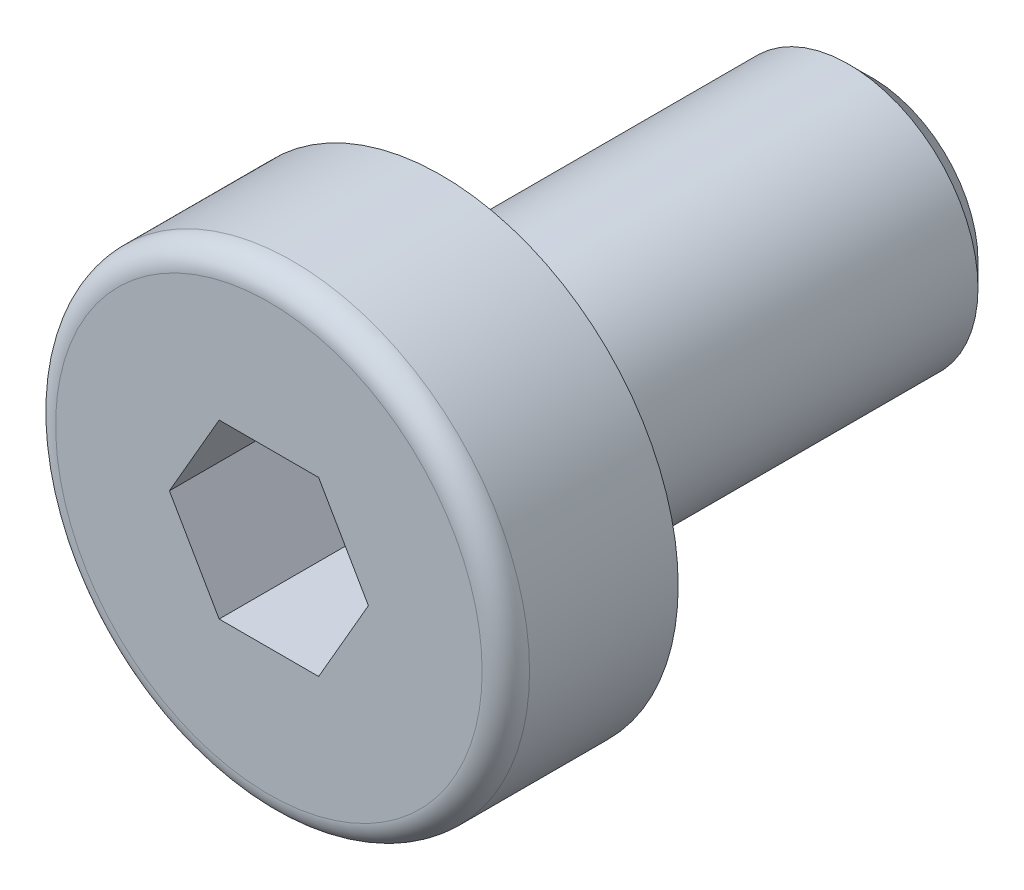
ISO-10303-21;
HEADER;
FILE_DESCRIPTION(('STEP AP214'),'2;1');
FILE_NAME('part.step','',(''),(''),'','','');
FILE_SCHEMA(('AUTOMOTIVE_DESIGN { 1 0 10303 214 1 1 1 1 }'));
ENDSEC;
DATA;
#1=APPLICATION_CONTEXT('core data for automotive mechanical design processes');
#2=APPLICATION_PROTOCOL_DEFINITION('international standard','automotive_design',2000,#1);
#3=PRODUCT_CONTEXT('',#1,'mechanical');
#4=PRODUCT('Part','Part','',(#3));
#5=PRODUCT_RELATED_PRODUCT_CATEGORY('part','',(#4));
#6=PRODUCT_DEFINITION_FORMATION('','',#4);
#7=PRODUCT_DEFINITION_CONTEXT('part definition',#1,'design');
#8=PRODUCT_DEFINITION('design','',#6,#7);
#9=PRODUCT_DEFINITION_SHAPE('','',#8);
#10=(LENGTH_UNIT() NAMED_UNIT(*) SI_UNIT(.MILLI.,.METRE.));
#11=(NAMED_UNIT(*) PLANE_ANGLE_UNIT() SI_UNIT($,.RADIAN.));
#12=(NAMED_UNIT(*) SI_UNIT($,.STERADIAN.) SOLID_ANGLE_UNIT());
#13=UNCERTAINTY_MEASURE_WITH_UNIT(LENGTH_MEASURE(1.E-05),#10,'distance_accuracy_value','');
#14=(GEOMETRIC_REPRESENTATION_CONTEXT(3) GLOBAL_UNCERTAINTY_ASSIGNED_CONTEXT((#13)) GLOBAL_UNIT_ASSIGNED_CONTEXT((#10,
#11,#12)) REPRESENTATION_CONTEXT('',''));
#15=CARTESIAN_POINT('',(0.,0.,0.));
#16=DIRECTION('',(0.,0.,1.));
#17=DIRECTION('',(1.,0.,0.));
#18=AXIS2_PLACEMENT_3D('',#15,#16,#17);
#19=CARTESIAN_POINT('',(0.,0.,2.));
#20=DIRECTION('',(0.,0.,1.));
#21=DIRECTION('',(1.,0.,0.));
#22=AXIS2_PLACEMENT_3D('',#19,#20,#21);
#23=CYLINDRICAL_SURFACE('',#22,1.5);
#24=CARTESIAN_POINT('',(0.,0.,-0.15));
#25=DIRECTION('',(0.,0.,1.));
#26=DIRECTION('',(1.,0.,0.));
#27=AXIS2_PLACEMENT_3D('',#24,#25,#26);
#28=CIRCLE('',#27,1.5);
#29=CARTESIAN_POINT('',(1.5,0.,-0.15));
#30=VERTEX_POINT('',#29);
#31=EDGE_CURVE('E135',#30,#30,#28,.T.);
#32=ORIENTED_EDGE('',*,*,#31,.F.);
#33=EDGE_LOOP('',(#32));
#34=FACE_BOUND('',#33,.T.);
#35=CARTESIAN_POINT('',(0.,0.,-0.155));
#36=DIRECTION('',(0.,0.,1.));
#37=DIRECTION('',(1.,0.,0.));
#38=AXIS2_PLACEMENT_3D('',#35,#36,#37);
#39=CIRCLE('',#38,1.5);
#40=CARTESIAN_POINT('',(1.5,0.,-0.155));
#41=VERTEX_POINT('',#40);
#42=EDGE_CURVE('E290',#41,#41,#39,.T.);
#43=ORIENTED_EDGE('',*,*,#42,.T.);
#44=EDGE_LOOP('',(#43));
#45=FACE_BOUND('',#44,.T.);
#46=ADVANCED_FACE('F16',(#34,#45),#23,.T.);
#47=CARTESIAN_POINT('',(0.,0.,2.));
#48=DIRECTION('',(0.,0.,1.));
#49=DIRECTION('',(1.,0.,0.));
#50=AXIS2_PLACEMENT_3D('',#47,#48,#49);
#51=PLANE('',#50);
#52=CARTESIAN_POINT('',(0.,0.,2.));
#53=DIRECTION('',(0.,0.,1.));
#54=DIRECTION('',(1.,0.,0.));
#55=AXIS2_PLACEMENT_3D('',#52,#53,#54);
#56=CIRCLE('',#55,2.475);
#57=CARTESIAN_POINT('',(2.475,0.,2.));
#58=VERTEX_POINT('',#57);
#59=EDGE_CURVE('E119',#58,#58,#56,.T.);
#60=ORIENTED_EDGE('',*,*,#59,.T.);
#61=EDGE_LOOP('',(#60));
#62=FACE_BOUND('',#61,.T.);
#63=DIRECTION('',(1.,0.,0.));
#64=VECTOR('',#63,1.);
#65=CARTESIAN_POINT('',(-0.57735,0.999999533749891,2.));
#66=LINE('',#65,#64);
#67=CARTESIAN_POINT('',(-0.57735,0.999999533749891,2.));
#68=VERTEX_POINT('',#67);
#69=CARTESIAN_POINT('',(0.57735,0.999999533749892,2.));
#70=VERTEX_POINT('',#69);
#71=EDGE_CURVE('E96',#68,#70,#66,.T.);
#72=ORIENTED_EDGE('',*,*,#71,.T.);
#73=DIRECTION('',(0.5,-0.866025403784439,0.));
#74=VECTOR('',#73,1.);
#75=CARTESIAN_POINT('',(0.57735,0.999999533749892,2.));
#76=LINE('',#75,#74);
#77=CARTESIAN_POINT('',(1.1547,0.,2.));
#78=VERTEX_POINT('',#77);
#79=EDGE_CURVE('E32',#70,#78,#76,.T.);
#80=ORIENTED_EDGE('',*,*,#79,.T.);
#81=DIRECTION('',(-0.5,-0.866025403784439,0.));
#82=VECTOR('',#81,1.);
#83=CARTESIAN_POINT('',(1.1547,0.,2.));
#84=LINE('',#83,#82);
#85=CARTESIAN_POINT('',(0.57735,-0.999999533749891,2.));
#86=VERTEX_POINT('',#85);
#87=EDGE_CURVE('E202',#78,#86,#84,.T.);
#88=ORIENTED_EDGE('',*,*,#87,.T.);
#89=DIRECTION('',(-1.,0.,0.));
#90=VECTOR('',#89,1.);
#91=CARTESIAN_POINT('',(0.57735,-0.999999533749891,2.));
#92=LINE('',#91,#90);
#93=CARTESIAN_POINT('',(-0.57735,-0.999999533749892,2.));
#94=VERTEX_POINT('',#93);
#95=EDGE_CURVE('E265',#86,#94,#92,.T.);
#96=ORIENTED_EDGE('',*,*,#95,.T.);
#97=DIRECTION('',(-0.5,0.866025403784439,0.));
#98=VECTOR('',#97,1.);
#99=CARTESIAN_POINT('',(-0.57735,-0.999999533749892,2.));
#100=LINE('',#99,#98);
#101=CARTESIAN_POINT('',(-1.1547,0.,2.));
#102=VERTEX_POINT('',#101);
#103=EDGE_CURVE('E259',#94,#102,#100,.T.);
#104=ORIENTED_EDGE('',*,*,#103,.T.);
#105=DIRECTION('',(0.5,0.866025403784439,0.));
#106=VECTOR('',#105,1.);
#107=CARTESIAN_POINT('',(-1.1547,0.,2.));
#108=LINE('',#107,#106);
#109=EDGE_CURVE('E105',#102,#68,#108,.T.);
#110=ORIENTED_EDGE('',*,*,#109,.T.);
#111=EDGE_LOOP('',(#72,#80,#88,#96,#104,#110));
#112=FACE_BOUND('',#111,.T.);
#113=ADVANCED_FACE('F159',(#62,#112),#51,.T.);
#114=CARTESIAN_POINT('',(0.,0.,-0.15));
#115=DIRECTION('',(0.,0.,1.));
#116=DIRECTION('',(1.,0.,0.));
#117=AXIS2_PLACEMENT_3D('',#114,#115,#116);
#118=TOROIDAL_SURFACE('',#117,1.65,0.15);
#119=ORIENTED_EDGE('',*,*,#31,.T.);
#120=EDGE_LOOP('',(#119));
#121=FACE_BOUND('',#120,.T.);
#122=CARTESIAN_POINT('',(0.,0.,0.));
#123=DIRECTION('',(0.,0.,1.));
#124=DIRECTION('',(1.,0.,0.));
#125=AXIS2_PLACEMENT_3D('',#122,#123,#124);
#126=CIRCLE('',#125,1.65);
#127=CARTESIAN_POINT('',(1.65,0.,0.));
#128=VERTEX_POINT('',#127);
#129=EDGE_CURVE('E131',#128,#128,#126,.T.);
#130=ORIENTED_EDGE('',*,*,#129,.F.);
#131=EDGE_LOOP('',(#130));
#132=FACE_BOUND('',#131,.T.);
#133=ADVANCED_FACE('F164',(#121,#132),#118,.F.);
#134=CARTESIAN_POINT('',(0.,2.75,0.));
#135=DIRECTION('',(0.,0.,-1.));
#136=DIRECTION('',(-1.,0.,0.));
#137=AXIS2_PLACEMENT_3D('',#134,#135,#136);
#138=PLANE('',#137);
#139=ORIENTED_EDGE('',*,*,#129,.T.);
#140=EDGE_LOOP('',(#139));
#141=FACE_BOUND('',#140,.T.);
#142=CARTESIAN_POINT('',(0.,0.,0.));
#143=DIRECTION('',(0.,0.,1.));
#144=DIRECTION('',(1.,0.,0.));
#145=AXIS2_PLACEMENT_3D('',#142,#143,#144);
#146=CIRCLE('',#145,2.75);
#147=CARTESIAN_POINT('',(2.75,0.,0.));
#148=VERTEX_POINT('',#147);
#149=EDGE_CURVE('E127',#148,#148,#146,.T.);
#150=ORIENTED_EDGE('',*,*,#149,.F.);
#151=EDGE_LOOP('',(#150));
#152=FACE_BOUND('',#151,.T.);
#153=ADVANCED_FACE('F172',(#141,#152),#138,.T.);
#154=CARTESIAN_POINT('',(0.,0.,2.));
#155=DIRECTION('',(0.,0.,1.));
#156=DIRECTION('',(1.,0.,0.));
#157=AXIS2_PLACEMENT_3D('',#154,#155,#156);
#158=CYLINDRICAL_SURFACE('',#157,2.75);
#159=ORIENTED_EDGE('',*,*,#149,.T.);
#160=EDGE_LOOP('',(#159));
#161=FACE_BOUND('',#160,.T.);
#162=CARTESIAN_POINT('',(0.,0.,1.725));
#163=DIRECTION('',(0.,0.,1.));
#164=DIRECTION('',(1.,0.,0.));
#165=AXIS2_PLACEMENT_3D('',#162,#163,#164);
#166=CIRCLE('',#165,2.75);
#167=CARTESIAN_POINT('',(2.75,0.,1.725));
#168=VERTEX_POINT('',#167);
#169=EDGE_CURVE('E123',#168,#168,#166,.T.);
#170=ORIENTED_EDGE('',*,*,#169,.F.);
#171=EDGE_LOOP('',(#170));
#172=FACE_BOUND('',#171,.T.);
#173=ADVANCED_FACE('F176',(#161,#172),#158,.T.);
#174=CARTESIAN_POINT('',(0.,0.,1.725));
#175=DIRECTION('',(0.,0.,1.));
#176=DIRECTION('',(1.,0.,0.));
#177=AXIS2_PLACEMENT_3D('',#174,#175,#176);
#178=TOROIDAL_SURFACE('',#177,2.475,0.275);
#179=ORIENTED_EDGE('',*,*,#59,.F.);
#180=EDGE_LOOP('',(#179));
#181=FACE_BOUND('',#180,.T.);
#182=ORIENTED_EDGE('',*,*,#169,.T.);
#183=EDGE_LOOP('',(#182));
#184=FACE_BOUND('',#183,.T.);
#185=ADVANCED_FACE('F180',(#181,#184),#178,.T.);
#186=CARTESIAN_POINT('',(0.57735,0.999999533749892,-0.166666355833261));
#187=DIRECTION('',(-0.866025403784438,-0.5,0.));
#188=DIRECTION('',(-0.5,0.866025403784439,0.));
#189=AXIS2_PLACEMENT_3D('',#186,#187,#188);
#190=PLANE('',#189);
#191=DIRECTION('',(0.,0.,1.));
#192=VECTOR('',#191,1.);
#193=CARTESIAN_POINT('',(1.1547,0.,-0.166666355833261));
#194=LINE('',#193,#192);
#195=CARTESIAN_POINT('',(1.1547,0.,0.5));
#196=VERTEX_POINT('',#195);
#197=EDGE_CURVE('E117',#196,#78,#194,.T.);
#198=ORIENTED_EDGE('',*,*,#197,.T.);
#199=ORIENTED_EDGE('',*,*,#79,.F.);
#200=DIRECTION('',(0.,0.,1.));
#201=VECTOR('',#200,1.);
#202=CARTESIAN_POINT('',(0.57735,0.999999533749892,-0.166666355833261));
#203=LINE('',#202,#201);
#204=CARTESIAN_POINT('',(0.57735,0.999999533749892,0.5));
#205=VERTEX_POINT('',#204);
#206=EDGE_CURVE('E89',#205,#70,#203,.T.);
#207=ORIENTED_EDGE('',*,*,#206,.F.);
#208=CARTESIAN_POINT('',(1.15470115470054,-2.00000000000572E-06,0.500000666667667));
#209=CARTESIAN_POINT('',(1.12933009927234,0.0439419570432813,0.485348391305477));
#210=CARTESIAN_POINT('',(1.10374004129754,0.0882652376242723,0.472022905343535));
#211=CARTESIAN_POINT('',(1.05211684902319,0.17767922949234,0.448763650624438));
#212=CARTESIAN_POINT('',(1.02608279776624,0.22277152899623,0.438838109245026));
#213=CARTESIAN_POINT('',(0.974337322784001,0.312397320727257,0.423388262242827));
#214=CARTESIAN_POINT('',(0.948633858612371,0.356917026603046,0.417761117781435));
#215=CARTESIAN_POINT('',(0.897106047785879,0.446165812957328,0.411044692486152));
#216=CARTESIAN_POINT('',(0.871281888296732,0.490894569255293,0.409949848585148));
#217=CARTESIAN_POINT('',(0.823032064442526,0.574465715627026,0.412233105011519));
#218=CARTESIAN_POINT('',(0.800599160429648,0.613320645138646,0.415050590143896));
#219=CARTESIAN_POINT('',(0.755879495715112,0.690777376521668,0.423978623797277));
#220=CARTESIAN_POINT('',(0.733592889575674,0.729378910683452,0.430092219241172));
#221=CARTESIAN_POINT('',(0.688781095362013,0.806995215039832,0.445375050219149));
#222=CARTESIAN_POINT('',(0.666261576071427,0.846000166613155,0.454609039560296));
#223=CARTESIAN_POINT('',(0.621558322302024,0.923428473405406,0.475566301407699));
#224=CARTESIAN_POINT('',(0.599374015548132,0.961852819833839,0.487284652833824));
#225=CARTESIAN_POINT('',(0.577348845299461,1.00000153374989,0.500000666667667));
#226=B_SPLINE_CURVE_WITH_KNOTS('',3,(#208,#209,#210,#211,#212,#213,#214,#215,#216,#217,#218,
#219,#220,#221,#222,#223,#224,#225),.UNSPECIFIED.,.F.,.F.,(4,2,2,2,2,2,2,2,4),(0.,
0.158508089994533,0.317397081098293,0.472354046423629,0.627120756921706,0.76185516297255,
0.896714331530991,1.0345640617321,1.17214324556804),.UNSPECIFIED.);
#227=EDGE_CURVE('E81',#196,#205,#226,.T.);
#228=ORIENTED_EDGE('',*,*,#227,.F.);
#229=EDGE_LOOP('',(#198,#199,#207,#228));
#230=FACE_BOUND('',#229,.T.);
#231=ADVANCED_FACE('F90',(#230),#190,.T.);
#232=CARTESIAN_POINT('',(1.1547,0.,-0.166666355833261));
#233=DIRECTION('',(-0.866025403784439,0.5,0.));
#234=DIRECTION('',(0.5,0.866025403784439,0.));
#235=AXIS2_PLACEMENT_3D('',#232,#233,#234);
#236=PLANE('',#235);
#237=DIRECTION('',(0.,0.,1.));
#238=VECTOR('',#237,1.);
#239=CARTESIAN_POINT('',(0.57735,-0.999999533749891,-0.166666355833261));
#240=LINE('',#239,#238);
#241=CARTESIAN_POINT('',(0.57735,-0.999999533749891,0.5));
#242=VERTEX_POINT('',#241);
#243=EDGE_CURVE('E114',#242,#86,#240,.T.);
#244=ORIENTED_EDGE('',*,*,#243,.T.);
#245=ORIENTED_EDGE('',*,*,#87,.F.);
#246=ORIENTED_EDGE('',*,*,#197,.F.);
#247=CARTESIAN_POINT('',(0.577348845299462,-1.00000153374989,0.500000666667667));
#248=CARTESIAN_POINT('',(0.602719900727658,-0.956057576706609,0.485348391305477));
#249=CARTESIAN_POINT('',(0.628309958702461,-0.911734296125618,0.472022905343535));
#250=CARTESIAN_POINT('',(0.679933150976809,-0.822320304257551,0.448763650624437));
#251=CARTESIAN_POINT('',(0.705967202233759,-0.77722800475366,0.438838109245026));
#252=CARTESIAN_POINT('',(0.757712677216,-0.687602213022634,0.423388262242826));
#253=CARTESIAN_POINT('',(0.783416141387629,-0.643082507146845,0.417761117781434));
#254=CARTESIAN_POINT('',(0.834943952214122,-0.553833720792563,0.411044692486152));
#255=CARTESIAN_POINT('',(0.860768111703269,-0.509104964494599,0.409949848585148));
#256=CARTESIAN_POINT('',(0.909017935557475,-0.425533818122866,0.412233105011519));
#257=CARTESIAN_POINT('',(0.931450839570352,-0.386678888611246,0.415050590143895));
#258=CARTESIAN_POINT('',(0.976170504284888,-0.309222157228223,0.423978623797277));
#259=CARTESIAN_POINT('',(0.998457110424327,-0.27062062306644,0.430092219241172));
#260=CARTESIAN_POINT('',(1.04326890463799,-0.193004318710059,0.445375050219149));
#261=CARTESIAN_POINT('',(1.06578842392857,-0.153999367136737,0.454609039560296));
#262=CARTESIAN_POINT('',(1.11049167769798,-0.0765710603444854,0.475566301407699));
#263=CARTESIAN_POINT('',(1.13267598445187,-0.0381467139160523,0.487284652833824));
#264=CARTESIAN_POINT('',(1.15470115470054,1.99999999992177E-06,0.500000666667667));
#265=B_SPLINE_CURVE_WITH_KNOTS('',3,(#247,#248,#249,#250,#251,#252,#253,#254,#255,#256,#257,
#258,#259,#260,#261,#262,#263,#264),.UNSPECIFIED.,.F.,.F.,(4,2,2,2,2,2,2,2,4),(0.,
0.158508089994532,0.317397081098292,0.472354046423628,0.627120756921704,0.761855162972548,
0.896714331530989,1.0345640617321,1.17214324556804),.UNSPECIFIED.);
#266=EDGE_CURVE('E85',#242,#196,#265,.T.);
#267=ORIENTED_EDGE('',*,*,#266,.F.);
#268=EDGE_LOOP('',(#244,#245,#246,#267));
#269=FACE_BOUND('',#268,.T.);
#270=ADVANCED_FACE('F188',(#269),#236,.T.);
#271=CARTESIAN_POINT('',(0.57735,-0.999999533749891,-0.166666355833261));
#272=DIRECTION('',(0.,1.,0.));
#273=DIRECTION('',(1.,0.,0.));
#274=AXIS2_PLACEMENT_3D('',#271,#272,#273);
#275=PLANE('',#274);
#276=DIRECTION('',(0.,0.,1.));
#277=VECTOR('',#276,1.);
#278=CARTESIAN_POINT('',(-0.57735,-0.999999533749892,-0.166666355833261));
#279=LINE('',#278,#277);
#280=CARTESIAN_POINT('',(-0.57735,-0.999999533749891,0.5));
#281=VERTEX_POINT('',#280);
#282=EDGE_CURVE('E111',#281,#94,#279,.T.);
#283=ORIENTED_EDGE('',*,*,#282,.T.);
#284=ORIENTED_EDGE('',*,*,#95,.F.);
#285=ORIENTED_EDGE('',*,*,#243,.F.);
#286=CARTESIAN_POINT('',(-1.49514442485991,-0.999999533749892,0.871835115629296));
#287=CARTESIAN_POINT('',(-1.45196058536606,-0.999999533749892,0.851114857654625));
#288=CARTESIAN_POINT('',(-1.40867216909359,-0.999999533749891,0.830613519073185));
#289=CARTESIAN_POINT('',(-1.32182886600433,-0.999999533749891,0.79016329969704));
#290=CARTESIAN_POINT('',(-1.2782739329316,-0.999999533749891,0.770214518325867));
#291=CARTESIAN_POINT('',(-1.14662287013031,-0.999999533749891,0.711145058952465));
#292=CARTESIAN_POINT('',(-1.05805675536899,-0.999999533749892,0.673052448903674));
#293=CARTESIAN_POINT('',(-0.876832601569535,-0.999999533749891,0.600245776691501));
#294=CARTESIAN_POINT('',(-0.784128092285833,-0.999999533749891,0.565645811890966));
#295=CARTESIAN_POINT('',(-0.596331471486308,-0.999999533749891,0.504073472768483));
#296=CARTESIAN_POINT('',(-0.501246273385447,-0.999999533749892,0.477081295872103));
#297=CARTESIAN_POINT('',(-0.356699820153757,-0.999999533749892,0.445775795318476));
#298=CARTESIAN_POINT('',(-0.308244019411516,-0.999999533749891,0.436875127970593));
#299=CARTESIAN_POINT('',(-0.210788772252078,-0.999999533749891,0.422742467757011));
#300=CARTESIAN_POINT('',(-0.161789362800288,-0.999999533749891,0.417510226972721));
#301=CARTESIAN_POINT('',(-0.0641060187969572,-0.999999533749891,0.411199022373477));
#302=CARTESIAN_POINT('',(-0.0154253386130912,-0.999999533749891,0.410071046937628));
#303=CARTESIAN_POINT('',(0.0818553185508148,-0.999999533749891,0.411933019381436));
#304=CARTESIAN_POINT('',(0.130455290347174,-0.999999533749891,0.414923222242145));
#305=CARTESIAN_POINT('',(0.250369475163949,-0.999999533749891,0.427118355954957));
#306=CARTESIAN_POINT('',(0.321451773511317,-0.999999533749891,0.43860859031067));
#307=CARTESIAN_POINT('',(0.462228831139483,-0.999999533749891,0.468240334123231));
#308=CARTESIAN_POINT('',(0.531921810918688,-0.999999533749891,0.486389859966797));
#309=CARTESIAN_POINT('',(0.671415426701006,-0.999999533749891,0.527869712973035));
#310=CARTESIAN_POINT('',(0.74118339183766,-0.999999533749891,0.551307147245494));
#311=CARTESIAN_POINT('',(0.879437913589634,-0.999999533749891,0.601564442476162));
#312=CARTESIAN_POINT('',(0.947924910374636,-0.999999533749891,0.628383116098255));
#313=CARTESIAN_POINT('',(1.12214344819038,-0.999999533749891,0.70005333402631));
#314=CARTESIAN_POINT('',(1.22718281828392,-0.999999533749891,0.746571151467414));
#315=CARTESIAN_POINT('',(1.43575436261154,-0.999999533749891,0.842874570096032));
#316=CARTESIAN_POINT('',(1.53928614185372,-0.999999533749891,0.892661009495929));
#317=CARTESIAN_POINT('',(1.74545816034081,-0.999999533749891,0.994332186801709));
#318=CARTESIAN_POINT('',(1.84809723800399,-0.999999533749891,1.04621927083694));
#319=CARTESIAN_POINT('',(2.05268820074271,-0.999999533749891,1.15133213897694));
#320=CARTESIAN_POINT('',(2.15464006298767,-0.999999533749891,1.20455796728207));
#321=CARTESIAN_POINT('',(2.34844987211842,-0.999999533749891,1.30685880508856));
#322=CARTESIAN_POINT('',(2.4403516275912,-0.999999533749891,1.35585099769028));
#323=CARTESIAN_POINT('',(2.62385949655876,-0.999999533749891,1.45439337097659));
#324=CARTESIAN_POINT('',(2.71546559895035,-0.999999533749891,1.50394357231047));
#325=CARTESIAN_POINT('',(2.89821733508574,-0.999999533749891,1.60333569467086));
#326=CARTESIAN_POINT('',(2.98936354739568,-0.99999953374989,1.65317655314389));
#327=CARTESIAN_POINT('',(3.17147169543988,-0.99999953374989,1.75318266354378));
#328=CARTESIAN_POINT('',(3.26243364056806,-0.999999533749891,1.80334789835804));
#329=CARTESIAN_POINT('',(3.35332938008973,-0.999999533749891,1.85363205437523));
#330=B_SPLINE_CURVE_WITH_KNOTS('',3,(#286,#287,#288,#289,#290,#291,#292,#293,#294,#295,#296,
#297,#298,#299,#300,#301,#302,#303,#304,#305,#306,#307,#308,#309,#310,#311,#312,#313,#314,#315,
#316,#317,#318,#319,#320,#321,#322,#323,#324,#325,#326,#327,#328,#329),.UNSPECIFIED.,.F.,.F.,(4,
2,2,2,2,2,2,2,2,2,2,2,2,2,2,2,2,2,2,2,2,4),(0.,0.143690272658494,0.287406234227527,
0.576560055393514,0.873259077741899,1.16917852539457,1.31686277501978,1.46453704292645,
1.6104419422712,1.75635587586723,1.9719244208457,2.1877533209983,2.40842488718949,
2.62901917835836,2.97354524236226,3.31816000509865,3.66317088870179,4.0081931782759,
4.32062550425272,4.63306943012528,4.94471865214482,5.25635156499876),.UNSPECIFIED.);
#331=EDGE_CURVE('E233',#281,#242,#330,.T.);
#332=ORIENTED_EDGE('',*,*,#331,.F.);
#333=EDGE_LOOP('',(#283,#284,#285,#332));
#334=FACE_BOUND('',#333,.T.);
#335=ADVANCED_FACE('F239',(#334),#275,.T.);
#336=CARTESIAN_POINT('',(-0.57735,-0.999999533749892,-0.166666355833261));
#337=DIRECTION('',(0.866025403784439,0.5,0.));
#338=DIRECTION('',(0.5,-0.866025403784439,0.));
#339=AXIS2_PLACEMENT_3D('',#336,#337,#338);
#340=PLANE('',#339);
#341=DIRECTION('',(0.,0.,1.));
#342=VECTOR('',#341,1.);
#343=CARTESIAN_POINT('',(-1.1547,0.,-0.166666355833261));
#344=LINE('',#343,#342);
#345=CARTESIAN_POINT('',(-1.1547,0.,0.5));
#346=VERTEX_POINT('',#345);
#347=EDGE_CURVE('E102',#346,#102,#344,.T.);
#348=ORIENTED_EDGE('',*,*,#347,.T.);
#349=ORIENTED_EDGE('',*,*,#103,.F.);
#350=ORIENTED_EDGE('',*,*,#282,.F.);
#351=CARTESIAN_POINT('',(-1.15470115470054,1.99999999966125E-06,0.500000666667667));
#352=CARTESIAN_POINT('',(-1.12933009927234,-0.0439419570432817,0.485348391305477));
#353=CARTESIAN_POINT('',(-1.10374004129754,-0.0882652376242729,0.472022905343535));
#354=CARTESIAN_POINT('',(-1.05211684902319,-0.177679229492341,0.448763650624438));
#355=CARTESIAN_POINT('',(-1.02608279776624,-0.222771528996231,0.438838109245026));
#356=CARTESIAN_POINT('',(-0.974337322784,-0.312397320727257,0.423388262242827));
#357=CARTESIAN_POINT('',(-0.948633858612371,-0.356917026603046,0.417761117781435));
#358=CARTESIAN_POINT('',(-0.897106047785879,-0.446165812957328,0.411044692486152));
#359=CARTESIAN_POINT('',(-0.871281888296732,-0.490894569255293,0.409949848585148));
#360=CARTESIAN_POINT('',(-0.823032064442526,-0.574465715627026,0.41223310501152));
#361=CARTESIAN_POINT('',(-0.800599160429648,-0.613320645138646,0.415050590143896));
#362=CARTESIAN_POINT('',(-0.755879495715112,-0.690777376521668,0.423978623797277));
#363=CARTESIAN_POINT('',(-0.733592889575674,-0.729378910683451,0.430092219241172));
#364=CARTESIAN_POINT('',(-0.688781095362013,-0.806995215039832,0.445375050219149));
#365=CARTESIAN_POINT('',(-0.666261576071427,-0.846000166613155,0.454609039560296));
#366=CARTESIAN_POINT('',(-0.621558322302024,-0.923428473405406,0.475566301407699));
#367=CARTESIAN_POINT('',(-0.599374015548132,-0.961852819833839,0.487284652833824));
#368=CARTESIAN_POINT('',(-0.577348845299461,-1.00000153374989,0.500000666667667));
#369=B_SPLINE_CURVE_WITH_KNOTS('',3,(#351,#352,#353,#354,#355,#356,#357,#358,#359,#360,#361,
#362,#363,#364,#365,#366,#367,#368),.UNSPECIFIED.,.F.,.F.,(4,2,2,2,2,2,2,2,4),(0.,
0.158508089994533,0.317397081098292,0.472354046423629,0.627120756921705,0.761855162972549,
0.89671433153099,1.0345640617321,1.17214324556804),.UNSPECIFIED.);
#370=EDGE_CURVE('E227',#346,#281,#369,.T.);
#371=ORIENTED_EDGE('',*,*,#370,.F.);
#372=EDGE_LOOP('',(#348,#349,#350,#371));
#373=FACE_BOUND('',#372,.T.);
#374=ADVANCED_FACE('F242',(#373),#340,.T.);
#375=CARTESIAN_POINT('',(-1.1547,0.,-0.166666355833261));
#376=DIRECTION('',(0.866025403784439,-0.5,0.));
#377=DIRECTION('',(-0.5,-0.866025403784439,0.));
#378=AXIS2_PLACEMENT_3D('',#375,#376,#377);
#379=PLANE('',#378);
#380=DIRECTION('',(0.,0.,1.));
#381=VECTOR('',#380,1.);
#382=CARTESIAN_POINT('',(-0.57735,0.999999533749891,-0.166666355833261));
#383=LINE('',#382,#381);
#384=CARTESIAN_POINT('',(-0.57735,0.999999533749891,0.5));
#385=VERTEX_POINT('',#384);
#386=EDGE_CURVE('E95',#385,#68,#383,.T.);
#387=ORIENTED_EDGE('',*,*,#386,.T.);
#388=ORIENTED_EDGE('',*,*,#109,.F.);
#389=ORIENTED_EDGE('',*,*,#347,.F.);
#390=CARTESIAN_POINT('',(-0.577348845299462,1.00000153374989,0.500000666667667));
#391=CARTESIAN_POINT('',(-0.602719900727658,0.956057576706609,0.485348391305477));
#392=CARTESIAN_POINT('',(-0.628309958702461,0.911734296125618,0.472022905343535));
#393=CARTESIAN_POINT('',(-0.679933150976809,0.82232030425755,0.448763650624437));
#394=CARTESIAN_POINT('',(-0.705967202233759,0.77722800475366,0.438838109245026));
#395=CARTESIAN_POINT('',(-0.757712677216,0.687602213022634,0.423388262242827));
#396=CARTESIAN_POINT('',(-0.78341614138763,0.643082507146845,0.417761117781435));
#397=CARTESIAN_POINT('',(-0.834943952214122,0.553833720792562,0.411044692486152));
#398=CARTESIAN_POINT('',(-0.860768111703269,0.509104964494598,0.409949848585148));
#399=CARTESIAN_POINT('',(-0.909017935557475,0.425533818122865,0.412233105011519));
#400=CARTESIAN_POINT('',(-0.931450839570352,0.386678888611245,0.415050590143895));
#401=CARTESIAN_POINT('',(-0.976170504284888,0.309222157228223,0.423978623797277));
#402=CARTESIAN_POINT('',(-0.998457110424327,0.27062062306644,0.430092219241172));
#403=CARTESIAN_POINT('',(-1.04326890463799,0.193004318710059,0.445375050219149));
#404=CARTESIAN_POINT('',(-1.06578842392857,0.153999367136737,0.454609039560296));
#405=CARTESIAN_POINT('',(-1.11049167769798,0.0765710603444859,0.475566301407699));
#406=CARTESIAN_POINT('',(-1.13267598445187,0.0381467139160528,0.487284652833824));
#407=CARTESIAN_POINT('',(-1.15470115470054,-2.00000000005676E-06,0.500000666667667));
#408=B_SPLINE_CURVE_WITH_KNOTS('',3,(#390,#391,#392,#393,#394,#395,#396,#397,#398,#399,#400,
#401,#402,#403,#404,#405,#406,#407),.UNSPECIFIED.,.F.,.F.,(4,2,2,2,2,2,2,2,4),(0.,
0.158508089994532,0.317397081098292,0.472354046423629,0.627120756921705,0.761855162972549,
0.896714331530989,1.0345640617321,1.17214324556804),.UNSPECIFIED.);
#409=EDGE_CURVE('E40',#385,#346,#408,.T.);
#410=ORIENTED_EDGE('',*,*,#409,.F.);
#411=EDGE_LOOP('',(#387,#388,#389,#410));
#412=FACE_BOUND('',#411,.T.);
#413=ADVANCED_FACE('F246',(#412),#379,.T.);
#414=CARTESIAN_POINT('',(-0.57735,0.999999533749891,-0.166666355833261));
#415=DIRECTION('',(0.,-1.,0.));
#416=DIRECTION('',(-1.,0.,0.));
#417=AXIS2_PLACEMENT_3D('',#414,#415,#416);
#418=PLANE('',#417);
#419=ORIENTED_EDGE('',*,*,#206,.T.);
#420=ORIENTED_EDGE('',*,*,#71,.F.);
#421=ORIENTED_EDGE('',*,*,#386,.F.);
#422=CARTESIAN_POINT('',(-1.49514442485992,0.999999533749891,0.871835115629296));
#423=CARTESIAN_POINT('',(-1.45196058536606,0.999999533749891,0.851114857654626));
#424=CARTESIAN_POINT('',(-1.40867216909359,0.999999533749891,0.830613519073186));
#425=CARTESIAN_POINT('',(-1.32182886600434,0.999999533749891,0.790163299697041));
#426=CARTESIAN_POINT('',(-1.2782739329316,0.999999533749891,0.770214518325867));
#427=CARTESIAN_POINT('',(-1.14662287013032,0.999999533749891,0.711145058952466));
#428=CARTESIAN_POINT('',(-1.05805675536899,0.999999533749891,0.673052448903675));
#429=CARTESIAN_POINT('',(-0.876832601569536,0.999999533749891,0.600245776691501));
#430=CARTESIAN_POINT('',(-0.784128092285835,0.999999533749891,0.565645811890966));
#431=CARTESIAN_POINT('',(-0.596331471486309,0.999999533749891,0.504073472768483));
#432=CARTESIAN_POINT('',(-0.501246273385448,0.999999533749891,0.477081295872103));
#433=CARTESIAN_POINT('',(-0.356699820153758,0.999999533749891,0.445775795318476));
#434=CARTESIAN_POINT('',(-0.308244019411517,0.999999533749891,0.436875127970593));
#435=CARTESIAN_POINT('',(-0.210788772252078,0.999999533749891,0.422742467757011));
#436=CARTESIAN_POINT('',(-0.161789362800289,0.999999533749891,0.417510226972721));
#437=CARTESIAN_POINT('',(-0.0641060187969578,0.999999533749891,0.411199022373477));
#438=CARTESIAN_POINT('',(-0.0154253386130918,0.999999533749891,0.410071046937628));
#439=CARTESIAN_POINT('',(0.0818553185508143,0.999999533749891,0.411933019381436));
#440=CARTESIAN_POINT('',(0.130455290347173,0.999999533749892,0.414923222242145));
#441=CARTESIAN_POINT('',(0.250369475163949,0.999999533749892,0.427118355954957));
#442=CARTESIAN_POINT('',(0.321451773511316,0.999999533749892,0.43860859031067));
#443=CARTESIAN_POINT('',(0.462228831139482,0.999999533749891,0.468240334123231));
#444=CARTESIAN_POINT('',(0.531921810918687,0.999999533749892,0.486389859966797));
#445=CARTESIAN_POINT('',(0.671415426701005,0.999999533749892,0.527869712973035));
#446=CARTESIAN_POINT('',(0.741183391837659,0.999999533749892,0.551307147245493));
#447=CARTESIAN_POINT('',(0.879437913589633,0.999999533749892,0.601564442476161));
#448=CARTESIAN_POINT('',(0.947924910374634,0.999999533749892,0.628383116098255));
#449=CARTESIAN_POINT('',(1.12214344819038,0.999999533749892,0.70005333402631));
#450=CARTESIAN_POINT('',(1.22718281828392,0.999999533749892,0.746571151467414));
#451=CARTESIAN_POINT('',(1.43575436261154,0.999999533749892,0.842874570096032));
#452=CARTESIAN_POINT('',(1.53928614185372,0.999999533749892,0.892661009495929));
#453=CARTESIAN_POINT('',(1.74545816034081,0.999999533749892,0.994332186801709));
#454=CARTESIAN_POINT('',(1.84809723800399,0.999999533749892,1.04621927083694));
#455=CARTESIAN_POINT('',(2.05268820074271,0.999999533749892,1.15133213897694));
#456=CARTESIAN_POINT('',(2.15464006298767,0.999999533749892,1.20455796728207));
#457=CARTESIAN_POINT('',(2.34844987211842,0.999999533749892,1.30685880508856));
#458=CARTESIAN_POINT('',(2.4403516275912,0.999999533749892,1.35585099769028));
#459=CARTESIAN_POINT('',(2.62385949655876,0.999999533749892,1.45439337097659));
#460=CARTESIAN_POINT('',(2.71546559895035,0.999999533749893,1.50394357231047));
#461=CARTESIAN_POINT('',(2.89821733508573,0.999999533749893,1.60333569467086));
#462=CARTESIAN_POINT('',(2.98936354739567,0.999999533749893,1.65317655314389));
#463=CARTESIAN_POINT('',(3.17147169543988,0.999999533749893,1.75318266354378));
#464=CARTESIAN_POINT('',(3.26243364056806,0.999999533749893,1.80334789835804));
#465=CARTESIAN_POINT('',(3.35332938008973,0.999999533749893,1.85363205437523));
#466=B_SPLINE_CURVE_WITH_KNOTS('',3,(#422,#423,#424,#425,#426,#427,#428,#429,#430,#431,#432,
#433,#434,#435,#436,#437,#438,#439,#440,#441,#442,#443,#444,#445,#446,#447,#448,#449,#450,#451,
#452,#453,#454,#455,#456,#457,#458,#459,#460,#461,#462,#463,#464,#465),.UNSPECIFIED.,.F.,.F.,(4,
2,2,2,2,2,2,2,2,2,2,2,2,2,2,2,2,2,2,2,2,4),(0.,0.143690272658494,0.287406234227527,
0.576560055393514,0.873259077741899,1.16917852539457,1.31686277501978,1.46453704292645,
1.6104419422712,1.75635587586723,1.9719244208457,2.1877533209983,2.40842488718949,
2.62901917835836,2.97354524236226,3.31816000509865,3.66317088870179,4.0081931782759,
4.32062550425272,4.63306943012528,4.94471865214482,5.25635156499876),.UNSPECIFIED.);
#467=EDGE_CURVE('E82',#205,#385,#466,.F.);
#468=ORIENTED_EDGE('',*,*,#467,.F.);
#469=EDGE_LOOP('',(#419,#420,#421,#468));
#470=FACE_BOUND('',#469,.T.);
#471=ADVANCED_FACE('F77',(#470),#418,.T.);
#472=CARTESIAN_POINT('',(0.,0.,-0.166666355833261));
#473=DIRECTION('',(0.,0.,1.));
#474=DIRECTION('',(1.,0.,0.));
#475=AXIS2_PLACEMENT_3D('',#472,#473,#474);
#476=CONICAL_SURFACE('',#475,0.,1.0471975511966);
#477=CARTESIAN_POINT('',(0.,0.,-0.166666355833261));
#478=VERTEX_POINT('',#477);
#479=VERTEX_LOOP('',#478);
#480=FACE_BOUND('',#479,.T.);
#481=ORIENTED_EDGE('',*,*,#227,.T.);
#482=ORIENTED_EDGE('',*,*,#467,.T.);
#483=ORIENTED_EDGE('',*,*,#409,.T.);
#484=ORIENTED_EDGE('',*,*,#370,.T.);
#485=ORIENTED_EDGE('',*,*,#331,.T.);
#486=ORIENTED_EDGE('',*,*,#266,.T.);
#487=EDGE_LOOP('',(#481,#482,#483,#484,#485,#486));
#488=FACE_BOUND('',#487,.T.);
#489=ADVANCED_FACE('F73',(#480,#488),#476,.F.);
#490=CARTESIAN_POINT('',(0.,0.,-0.155));
#491=DIRECTION('',(0.,0.,1.));
#492=DIRECTION('',(1.,0.,0.));
#493=AXIS2_PLACEMENT_3D('',#490,#491,#492);
#494=CONICAL_SURFACE('',#493,1.5,0.523598775598299);
#495=CARTESIAN_POINT('',(0.,0.,-0.623736249798327));
#496=DIRECTION('',(0.,0.,1.));
#497=DIRECTION('',(1.,0.,0.));
#498=AXIS2_PLACEMENT_3D('',#495,#496,#497);
#499=CIRCLE('',#498,1.229375);
#500=CARTESIAN_POINT('',(1.229375,0.,-0.623736249798327));
#501=VERTEX_POINT('',#500);
#502=EDGE_CURVE('E293',#501,#501,#499,.T.);
#503=ORIENTED_EDGE('',*,*,#502,.T.);
#504=EDGE_LOOP('',(#503));
#505=FACE_BOUND('',#504,.T.);
#506=ORIENTED_EDGE('',*,*,#42,.F.);
#507=EDGE_LOOP('',(#506));
#508=FACE_BOUND('',#507,.T.);
#509=ADVANCED_FACE('F76',(#505,#508),#494,.T.);
#510=CARTESIAN_POINT('',(0.,1.229375,-0.623736249798327));
#511=DIRECTION('',(0.,0.,1.));
#512=DIRECTION('',(1.,0.,0.));
#513=AXIS2_PLACEMENT_3D('',#510,#511,#512);
#514=PLANE('',#513);
#515=CARTESIAN_POINT('',(0.,0.,-0.623736249798327));
#516=DIRECTION('',(0.,0.,1.));
#517=DIRECTION('',(1.,0.,0.));
#518=AXIS2_PLACEMENT_3D('',#515,#516,#517);
#519=CIRCLE('',#518,1.5);
#520=CARTESIAN_POINT('',(1.5,0.,-0.623736249798327));
#521=VERTEX_POINT('',#520);
#522=EDGE_CURVE('E459',#521,#521,#519,.T.);
#523=ORIENTED_EDGE('',*,*,#522,.T.);
#524=EDGE_LOOP('',(#523));
#525=FACE_BOUND('',#524,.T.);
#526=ORIENTED_EDGE('',*,*,#502,.F.);
#527=EDGE_LOOP('',(#526));
#528=FACE_BOUND('',#527,.T.);
#529=ADVANCED_FACE('F156',(#525,#528),#514,.T.);
#530=CARTESIAN_POINT('',(0.,1.229375,-5.));
#531=DIRECTION('',(0.,0.,-1.));
#532=DIRECTION('',(-1.,0.,0.));
#533=AXIS2_PLACEMENT_3D('',#530,#531,#532);
#534=PLANE('',#533);
#535=CARTESIAN_POINT('',(0.,0.,-5.));
#536=DIRECTION('',(0.,0.,1.));
#537=DIRECTION('',(1.,0.,0.));
#538=AXIS2_PLACEMENT_3D('',#535,#536,#537);
#539=CIRCLE('',#538,1.229375);
#540=CARTESIAN_POINT('',(1.229375,0.,-5.));
#541=VERTEX_POINT('',#540);
#542=EDGE_CURVE('E11',#541,#541,#539,.T.);
#543=ORIENTED_EDGE('',*,*,#542,.F.);
#544=EDGE_LOOP('',(#543));
#545=FACE_BOUND('',#544,.T.);
#546=ADVANCED_FACE('F18',(#545),#534,.T.);
#547=CARTESIAN_POINT('',(0.,0.,-4.729375));
#548=DIRECTION('',(0.,0.,1.));
#549=DIRECTION('',(1.,0.,0.));
#550=AXIS2_PLACEMENT_3D('',#547,#548,#549);
#551=CONICAL_SURFACE('',#550,1.5,0.785398163397449);
#552=ORIENTED_EDGE('',*,*,#542,.T.);
#553=EDGE_LOOP('',(#552));
#554=FACE_BOUND('',#553,.T.);
#555=CARTESIAN_POINT('',(0.,0.,-4.729375));
#556=DIRECTION('',(0.,0.,1.));
#557=DIRECTION('',(1.,0.,0.));
#558=AXIS2_PLACEMENT_3D('',#555,#556,#557);
#559=CIRCLE('',#558,1.5);
#560=CARTESIAN_POINT('',(1.5,0.,-4.729375));
#561=VERTEX_POINT('',#560);
#562=EDGE_CURVE('E25',#561,#561,#559,.T.);
#563=ORIENTED_EDGE('',*,*,#562,.F.);
#564=EDGE_LOOP('',(#563));
#565=FACE_BOUND('',#564,.T.);
#566=ADVANCED_FACE('F147',(#554,#565),#551,.T.);
#567=ORIENTED_EDGE('',*,*,#562,.T.);
#568=EDGE_LOOP('',(#567));
#569=FACE_BOUND('',#568,.T.);
#570=ORIENTED_EDGE('',*,*,#522,.F.);
#571=EDGE_LOOP('',(#570));
#572=FACE_BOUND('',#571,.T.);
#573=ADVANCED_FACE('F144',(#569,#572),#23,.T.);
#574=CLOSED_SHELL('',(#46,#113,#133,#153,#173,#185,#231,#270,#335,#374,#413,#471,#489,#509,#529,
#546,#566,#573));
#575=MANIFOLD_SOLID_BREP('B1',#574);
#576=ADVANCED_BREP_SHAPE_REPRESENTATION('',(#18,#575),#14);
#577=SHAPE_DEFINITION_REPRESENTATION(#9,#576);
ENDSEC;
END-ISO-10303-21;
